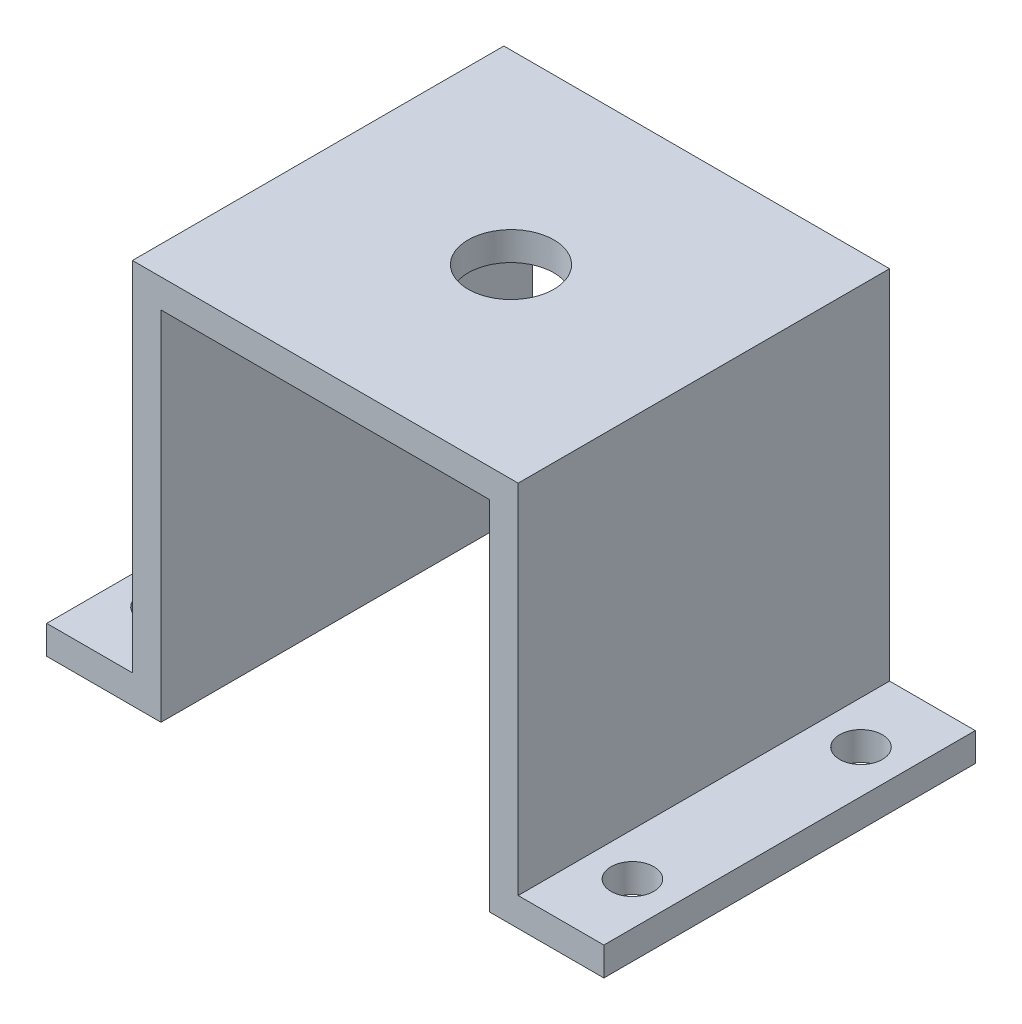
ISO-10303-21;
HEADER;
FILE_DESCRIPTION(('STEP AP214'),'2;1');
FILE_NAME('part.step','',(''),(''),'','','');
FILE_SCHEMA(('AUTOMOTIVE_DESIGN { 1 0 10303 214 1 1 1 1 }'));
ENDSEC;
DATA;
#1=APPLICATION_CONTEXT('core data for automotive mechanical design processes');
#2=APPLICATION_PROTOCOL_DEFINITION('international standard','automotive_design',2000,#1);
#3=PRODUCT_CONTEXT('',#1,'mechanical');
#4=PRODUCT('Part','Part','',(#3));
#5=PRODUCT_RELATED_PRODUCT_CATEGORY('part','',(#4));
#6=PRODUCT_DEFINITION_FORMATION('','',#4);
#7=PRODUCT_DEFINITION_CONTEXT('part definition',#1,'design');
#8=PRODUCT_DEFINITION('design','',#6,#7);
#9=PRODUCT_DEFINITION_SHAPE('','',#8);
#10=(LENGTH_UNIT() NAMED_UNIT(*) SI_UNIT(.MILLI.,.METRE.));
#11=(NAMED_UNIT(*) PLANE_ANGLE_UNIT() SI_UNIT($,.RADIAN.));
#12=(NAMED_UNIT(*) SI_UNIT($,.STERADIAN.) SOLID_ANGLE_UNIT());
#13=UNCERTAINTY_MEASURE_WITH_UNIT(LENGTH_MEASURE(1.E-05),#10,'distance_accuracy_value','');
#14=(GEOMETRIC_REPRESENTATION_CONTEXT(3) GLOBAL_UNCERTAINTY_ASSIGNED_CONTEXT((#13)) GLOBAL_UNIT_ASSIGNED_CONTEXT((#10,
#11,#12)) REPRESENTATION_CONTEXT('',''));
#15=CARTESIAN_POINT('',(0.,0.,0.));
#16=DIRECTION('',(0.,0.,1.));
#17=DIRECTION('',(1.,0.,0.));
#18=AXIS2_PLACEMENT_3D('',#15,#16,#17);
#19=CARTESIAN_POINT('',(31.,0.,26.));
#20=DIRECTION('',(0.,-1.,0.));
#21=DIRECTION('',(1.,0.,0.));
#22=AXIS2_PLACEMENT_3D('',#19,#20,#21);
#23=PLANE('',#22);
#24=CARTESIAN_POINT('',(28.,0.,21.));
#25=DIRECTION('',(0.,-1.,0.));
#26=DIRECTION('',(1.,0.,0.));
#27=AXIS2_PLACEMENT_3D('',#24,#25,#26);
#28=CIRCLE('',#27,1.5);
#29=CARTESIAN_POINT('',(29.5,0.,21.));
#30=VERTEX_POINT('',#29);
#31=EDGE_CURVE('E262',#30,#30,#28,.T.);
#32=ORIENTED_EDGE('',*,*,#31,.F.);
#33=EDGE_LOOP('',(#32));
#34=FACE_BOUND('',#33,.T.);
#35=DIRECTION('',(-1.,0.,0.));
#36=VECTOR('',#35,1.);
#37=CARTESIAN_POINT('',(31.,0.,0.));
#38=LINE('',#37,#36);
#39=CARTESIAN_POINT('',(31.,0.,0.));
#40=VERTEX_POINT('',#39);
#41=CARTESIAN_POINT('',(23.,0.,0.));
#42=VERTEX_POINT('',#41);
#43=EDGE_CURVE('E171',#40,#42,#38,.T.);
#44=ORIENTED_EDGE('',*,*,#43,.F.);
#45=DIRECTION('',(0.,0.,-1.));
#46=VECTOR('',#45,1.);
#47=CARTESIAN_POINT('',(31.,0.,26.));
#48=LINE('',#47,#46);
#49=CARTESIAN_POINT('',(31.,0.,26.));
#50=VERTEX_POINT('',#49);
#51=EDGE_CURVE('E187',#50,#40,#48,.T.);
#52=ORIENTED_EDGE('',*,*,#51,.F.);
#53=DIRECTION('',(-1.,0.,0.));
#54=VECTOR('',#53,1.);
#55=CARTESIAN_POINT('',(31.,0.,26.));
#56=LINE('',#55,#54);
#57=CARTESIAN_POINT('',(23.,0.,26.));
#58=VERTEX_POINT('',#57);
#59=EDGE_CURVE('E229',#50,#58,#56,.T.);
#60=ORIENTED_EDGE('',*,*,#59,.T.);
#61=DIRECTION('',(0.,0.,-1.));
#62=VECTOR('',#61,1.);
#63=CARTESIAN_POINT('',(23.,0.,26.));
#64=LINE('',#63,#62);
#65=EDGE_CURVE('E189',#58,#42,#64,.T.);
#66=ORIENTED_EDGE('',*,*,#65,.T.);
#67=EDGE_LOOP('',(#44,#52,#60,#66));
#68=FACE_BOUND('',#67,.T.);
#69=CARTESIAN_POINT('',(28.,0.,5.));
#70=DIRECTION('',(0.,-1.,0.));
#71=DIRECTION('',(1.,0.,0.));
#72=AXIS2_PLACEMENT_3D('',#69,#70,#71);
#73=CIRCLE('',#72,1.5);
#74=CARTESIAN_POINT('',(29.5,0.,5.));
#75=VERTEX_POINT('',#74);
#76=EDGE_CURVE('E254',#75,#75,#73,.T.);
#77=ORIENTED_EDGE('',*,*,#76,.F.);
#78=EDGE_LOOP('',(#77));
#79=FACE_BOUND('',#78,.T.);
#80=ADVANCED_FACE('F31',(#34,#68,#79),#23,.T.);
#81=CARTESIAN_POINT('',(31.,2.,26.));
#82=DIRECTION('',(0.,-1.,0.));
#83=DIRECTION('',(1.,0.,0.));
#84=AXIS2_PLACEMENT_3D('',#81,#82,#83);
#85=PLANE('',#84);
#86=CARTESIAN_POINT('',(28.,2.00000000000001,21.));
#87=DIRECTION('',(0.,-1.,0.));
#88=DIRECTION('',(0.,0.,1.));
#89=AXIS2_PLACEMENT_3D('',#86,#87,#88);
#90=CIRCLE('',#89,1.5);
#91=CARTESIAN_POINT('',(28.,2.00000000000001,22.5));
#92=VERTEX_POINT('',#91);
#93=EDGE_CURVE('E257',#92,#92,#90,.T.);
#94=ORIENTED_EDGE('',*,*,#93,.T.);
#95=EDGE_LOOP('',(#94));
#96=FACE_BOUND('',#95,.T.);
#97=DIRECTION('',(-1.,0.,0.));
#98=VECTOR('',#97,1.);
#99=CARTESIAN_POINT('',(31.,2.,0.));
#100=LINE('',#99,#98);
#101=CARTESIAN_POINT('',(31.,2.,0.));
#102=VERTEX_POINT('',#101);
#103=CARTESIAN_POINT('',(25.,2.,0.));
#104=VERTEX_POINT('',#103);
#105=EDGE_CURVE('E177',#102,#104,#100,.T.);
#106=ORIENTED_EDGE('',*,*,#105,.T.);
#107=DIRECTION('',(0.,0.,-1.));
#108=VECTOR('',#107,1.);
#109=CARTESIAN_POINT('',(25.,2.,26.));
#110=LINE('',#109,#108);
#111=CARTESIAN_POINT('',(25.,2.,26.));
#112=VERTEX_POINT('',#111);
#113=EDGE_CURVE('E143',#112,#104,#110,.T.);
#114=ORIENTED_EDGE('',*,*,#113,.F.);
#115=DIRECTION('',(-1.,0.,0.));
#116=VECTOR('',#115,1.);
#117=CARTESIAN_POINT('',(31.,2.,26.));
#118=LINE('',#117,#116);
#119=CARTESIAN_POINT('',(31.,2.,26.));
#120=VERTEX_POINT('',#119);
#121=EDGE_CURVE('E134',#120,#112,#118,.T.);
#122=ORIENTED_EDGE('',*,*,#121,.F.);
#123=DIRECTION('',(0.,0.,-1.));
#124=VECTOR('',#123,1.);
#125=CARTESIAN_POINT('',(31.,2.,26.));
#126=LINE('',#125,#124);
#127=EDGE_CURVE('E185',#120,#102,#126,.T.);
#128=ORIENTED_EDGE('',*,*,#127,.T.);
#129=EDGE_LOOP('',(#106,#114,#122,#128));
#130=FACE_BOUND('',#129,.T.);
#131=CARTESIAN_POINT('',(28.,2.00000000000001,5.));
#132=DIRECTION('',(0.,-1.,0.));
#133=DIRECTION('',(0.,0.,1.));
#134=AXIS2_PLACEMENT_3D('',#131,#132,#133);
#135=CIRCLE('',#134,1.5);
#136=CARTESIAN_POINT('',(28.,2.00000000000001,6.5));
#137=VERTEX_POINT('',#136);
#138=EDGE_CURVE('E252',#137,#137,#135,.T.);
#139=ORIENTED_EDGE('',*,*,#138,.T.);
#140=EDGE_LOOP('',(#139));
#141=FACE_BOUND('',#140,.T.);
#142=ADVANCED_FACE('F245',(#96,#130,#141),#85,.F.);
#143=CARTESIAN_POINT('',(-8.,2.,26.));
#144=DIRECTION('',(0.,-1.,0.));
#145=DIRECTION('',(0.,0.,-1.));
#146=AXIS2_PLACEMENT_3D('',#143,#144,#145);
#147=PLANE('',#146);
#148=CARTESIAN_POINT('',(-5.,2.,5.));
#149=DIRECTION('',(0.,1.,0.));
#150=DIRECTION('',(0.,0.,1.));
#151=AXIS2_PLACEMENT_3D('',#148,#149,#150);
#152=CIRCLE('',#151,1.5);
#153=CARTESIAN_POINT('',(-5.,2.,6.5));
#154=VERTEX_POINT('',#153);
#155=EDGE_CURVE('E266',#154,#154,#152,.T.);
#156=ORIENTED_EDGE('',*,*,#155,.F.);
#157=EDGE_LOOP('',(#156));
#158=FACE_BOUND('',#157,.T.);
#159=CARTESIAN_POINT('',(-5.,2.,21.));
#160=DIRECTION('',(0.,1.,0.));
#161=DIRECTION('',(0.,0.,1.));
#162=AXIS2_PLACEMENT_3D('',#159,#160,#161);
#163=CIRCLE('',#162,1.5);
#164=CARTESIAN_POINT('',(-5.,2.,22.5));
#165=VERTEX_POINT('',#164);
#166=EDGE_CURVE('E272',#165,#165,#163,.T.);
#167=ORIENTED_EDGE('',*,*,#166,.F.);
#168=EDGE_LOOP('',(#167));
#169=FACE_BOUND('',#168,.T.);
#170=DIRECTION('',(1.,0.,0.));
#171=VECTOR('',#170,1.);
#172=CARTESIAN_POINT('',(-8.,2.,0.));
#173=LINE('',#172,#171);
#174=CARTESIAN_POINT('',(-2.,2.,0.));
#175=VERTEX_POINT('',#174);
#176=CARTESIAN_POINT('',(-8.,2.,0.));
#177=VERTEX_POINT('',#176);
#178=EDGE_CURVE('E152',#175,#177,#173,.F.);
#179=ORIENTED_EDGE('',*,*,#178,.T.);
#180=DIRECTION('',(0.,0.,-1.));
#181=VECTOR('',#180,1.);
#182=CARTESIAN_POINT('',(-8.,2.,26.));
#183=LINE('',#182,#181);
#184=CARTESIAN_POINT('',(-8.,2.,26.));
#185=VERTEX_POINT('',#184);
#186=EDGE_CURVE('E11',#185,#177,#183,.T.);
#187=ORIENTED_EDGE('',*,*,#186,.F.);
#188=DIRECTION('',(1.,0.,0.));
#189=VECTOR('',#188,1.);
#190=CARTESIAN_POINT('',(-8.,2.,26.));
#191=LINE('',#190,#189);
#192=CARTESIAN_POINT('',(-2.,2.,26.));
#193=VERTEX_POINT('',#192);
#194=EDGE_CURVE('E100',#193,#185,#191,.F.);
#195=ORIENTED_EDGE('',*,*,#194,.F.);
#196=DIRECTION('',(0.,0.,-1.));
#197=VECTOR('',#196,1.);
#198=CARTESIAN_POINT('',(-2.,2.,26.));
#199=LINE('',#198,#197);
#200=EDGE_CURVE('E148',#193,#175,#199,.T.);
#201=ORIENTED_EDGE('',*,*,#200,.T.);
#202=EDGE_LOOP('',(#179,#187,#195,#201));
#203=FACE_BOUND('',#202,.T.);
#204=ADVANCED_FACE('F33',(#158,#169,#203),#147,.F.);
#205=CARTESIAN_POINT('',(-8.,0.,26.));
#206=DIRECTION('',(-1.,0.,0.));
#207=DIRECTION('',(0.,0.,1.));
#208=AXIS2_PLACEMENT_3D('',#205,#206,#207);
#209=PLANE('',#208);
#210=DIRECTION('',(0.,1.,0.));
#211=VECTOR('',#210,1.);
#212=CARTESIAN_POINT('',(-8.,0.,0.));
#213=LINE('',#212,#211);
#214=CARTESIAN_POINT('',(-8.,0.,0.));
#215=VERTEX_POINT('',#214);
#216=EDGE_CURVE('E155',#215,#177,#213,.T.);
#217=ORIENTED_EDGE('',*,*,#216,.F.);
#218=DIRECTION('',(0.,0.,-1.));
#219=VECTOR('',#218,1.);
#220=CARTESIAN_POINT('',(-8.,0.,26.));
#221=LINE('',#220,#219);
#222=CARTESIAN_POINT('',(-8.,0.,26.));
#223=VERTEX_POINT('',#222);
#224=EDGE_CURVE('E40',#223,#215,#221,.T.);
#225=ORIENTED_EDGE('',*,*,#224,.F.);
#226=DIRECTION('',(0.,1.,0.));
#227=VECTOR('',#226,1.);
#228=CARTESIAN_POINT('',(-8.,0.,26.));
#229=LINE('',#228,#227);
#230=EDGE_CURVE('E218',#223,#185,#229,.T.);
#231=ORIENTED_EDGE('',*,*,#230,.T.);
#232=ORIENTED_EDGE('',*,*,#186,.T.);
#233=EDGE_LOOP('',(#217,#225,#231,#232));
#234=FACE_BOUND('',#233,.T.);
#235=ADVANCED_FACE('F205',(#234),#209,.T.);
#236=CARTESIAN_POINT('',(-8.,0.,26.));
#237=DIRECTION('',(0.,-1.,0.));
#238=DIRECTION('',(0.,0.,-1.));
#239=AXIS2_PLACEMENT_3D('',#236,#237,#238);
#240=PLANE('',#239);
#241=CARTESIAN_POINT('',(-5.,0.,5.));
#242=DIRECTION('',(0.,-1.,0.));
#243=DIRECTION('',(0.,0.,-1.));
#244=AXIS2_PLACEMENT_3D('',#241,#242,#243);
#245=CIRCLE('',#244,1.5);
#246=CARTESIAN_POINT('',(-5.,0.,3.5));
#247=VERTEX_POINT('',#246);
#248=EDGE_CURVE('E265',#247,#247,#245,.F.);
#249=ORIENTED_EDGE('',*,*,#248,.T.);
#250=EDGE_LOOP('',(#249));
#251=FACE_BOUND('',#250,.T.);
#252=CARTESIAN_POINT('',(-5.,0.,21.));
#253=DIRECTION('',(0.,-1.,0.));
#254=DIRECTION('',(0.,0.,-1.));
#255=AXIS2_PLACEMENT_3D('',#252,#253,#254);
#256=CIRCLE('',#255,1.5);
#257=CARTESIAN_POINT('',(-5.,0.,19.5));
#258=VERTEX_POINT('',#257);
#259=EDGE_CURVE('E269',#258,#258,#256,.F.);
#260=ORIENTED_EDGE('',*,*,#259,.T.);
#261=EDGE_LOOP('',(#260));
#262=FACE_BOUND('',#261,.T.);
#263=DIRECTION('',(-1.,0.,0.));
#264=VECTOR('',#263,1.);
#265=CARTESIAN_POINT('',(-8.,0.,0.));
#266=LINE('',#265,#264);
#267=CARTESIAN_POINT('',(0.,0.,0.));
#268=VERTEX_POINT('',#267);
#269=EDGE_CURVE('E159',#268,#215,#266,.T.);
#270=ORIENTED_EDGE('',*,*,#269,.F.);
#271=DIRECTION('',(0.,0.,-1.));
#272=VECTOR('',#271,1.);
#273=CARTESIAN_POINT('',(0.,0.,26.));
#274=LINE('',#273,#272);
#275=CARTESIAN_POINT('',(0.,0.,26.));
#276=VERTEX_POINT('',#275);
#277=EDGE_CURVE('E195',#276,#268,#274,.T.);
#278=ORIENTED_EDGE('',*,*,#277,.F.);
#279=DIRECTION('',(-1.,0.,0.));
#280=VECTOR('',#279,1.);
#281=CARTESIAN_POINT('',(-8.,0.,26.));
#282=LINE('',#281,#280);
#283=EDGE_CURVE('E202',#276,#223,#282,.T.);
#284=ORIENTED_EDGE('',*,*,#283,.T.);
#285=ORIENTED_EDGE('',*,*,#224,.T.);
#286=EDGE_LOOP('',(#270,#278,#284,#285));
#287=FACE_BOUND('',#286,.T.);
#288=ADVANCED_FACE('F200',(#251,#262,#287),#240,.T.);
#289=CARTESIAN_POINT('',(0.,0.,26.));
#290=DIRECTION('',(1.,0.,0.));
#291=DIRECTION('',(0.,1.,0.));
#292=AXIS2_PLACEMENT_3D('',#289,#290,#291);
#293=PLANE('',#292);
#294=DIRECTION('',(0.,-1.,0.));
#295=VECTOR('',#294,1.);
#296=CARTESIAN_POINT('',(0.,0.,0.));
#297=LINE('',#296,#295);
#298=CARTESIAN_POINT('',(0.,25.,0.));
#299=VERTEX_POINT('',#298);
#300=EDGE_CURVE('E162',#299,#268,#297,.T.);
#301=ORIENTED_EDGE('',*,*,#300,.F.);
#302=DIRECTION('',(0.,0.,-1.));
#303=VECTOR('',#302,1.);
#304=CARTESIAN_POINT('',(0.,25.,26.));
#305=LINE('',#304,#303);
#306=CARTESIAN_POINT('',(0.,25.,26.));
#307=VERTEX_POINT('',#306);
#308=EDGE_CURVE('E193',#307,#299,#305,.T.);
#309=ORIENTED_EDGE('',*,*,#308,.F.);
#310=DIRECTION('',(0.,-1.,0.));
#311=VECTOR('',#310,1.);
#312=CARTESIAN_POINT('',(0.,0.,26.));
#313=LINE('',#312,#311);
#314=EDGE_CURVE('E215',#307,#276,#313,.T.);
#315=ORIENTED_EDGE('',*,*,#314,.T.);
#316=ORIENTED_EDGE('',*,*,#277,.T.);
#317=EDGE_LOOP('',(#301,#309,#315,#316));
#318=FACE_BOUND('',#317,.T.);
#319=ADVANCED_FACE('F212',(#318),#293,.T.);
#320=CARTESIAN_POINT('',(0.,25.,26.));
#321=DIRECTION('',(0.,-1.,0.));
#322=DIRECTION('',(1.,0.,0.));
#323=AXIS2_PLACEMENT_3D('',#320,#321,#322);
#324=PLANE('',#323);
#325=CARTESIAN_POINT('',(11.5,25.,13.));
#326=DIRECTION('',(0.,-1.,0.));
#327=DIRECTION('',(1.,0.,0.));
#328=AXIS2_PLACEMENT_3D('',#325,#326,#327);
#329=CIRCLE('',#328,3.);
#330=CARTESIAN_POINT('',(14.5,25.,13.));
#331=VERTEX_POINT('',#330);
#332=EDGE_CURVE('E275',#331,#331,#329,.F.);
#333=ORIENTED_EDGE('',*,*,#332,.T.);
#334=EDGE_LOOP('',(#333));
#335=FACE_BOUND('',#334,.T.);
#336=DIRECTION('',(-1.,0.,0.));
#337=VECTOR('',#336,1.);
#338=CARTESIAN_POINT('',(0.,25.,0.));
#339=LINE('',#338,#337);
#340=CARTESIAN_POINT('',(23.,25.,0.));
#341=VERTEX_POINT('',#340);
#342=EDGE_CURVE('E165',#341,#299,#339,.T.);
#343=ORIENTED_EDGE('',*,*,#342,.F.);
#344=DIRECTION('',(0.,0.,-1.));
#345=VECTOR('',#344,1.);
#346=CARTESIAN_POINT('',(23.,25.,26.));
#347=LINE('',#346,#345);
#348=CARTESIAN_POINT('',(23.,25.,26.));
#349=VERTEX_POINT('',#348);
#350=EDGE_CURVE('E191',#349,#341,#347,.T.);
#351=ORIENTED_EDGE('',*,*,#350,.F.);
#352=DIRECTION('',(-1.,0.,0.));
#353=VECTOR('',#352,1.);
#354=CARTESIAN_POINT('',(0.,25.,26.));
#355=LINE('',#354,#353);
#356=EDGE_CURVE('E220',#349,#307,#355,.T.);
#357=ORIENTED_EDGE('',*,*,#356,.T.);
#358=ORIENTED_EDGE('',*,*,#308,.T.);
#359=EDGE_LOOP('',(#343,#351,#357,#358));
#360=FACE_BOUND('',#359,.T.);
#361=ADVANCED_FACE('F283',(#335,#360),#324,.T.);
#362=CARTESIAN_POINT('',(23.,25.,26.));
#363=DIRECTION('',(-1.,0.,0.));
#364=DIRECTION('',(0.,0.,1.));
#365=AXIS2_PLACEMENT_3D('',#362,#363,#364);
#366=PLANE('',#365);
#367=DIRECTION('',(0.,1.,0.));
#368=VECTOR('',#367,1.);
#369=CARTESIAN_POINT('',(23.,25.,0.));
#370=LINE('',#369,#368);
#371=EDGE_CURVE('E168',#42,#341,#370,.T.);
#372=ORIENTED_EDGE('',*,*,#371,.F.);
#373=ORIENTED_EDGE('',*,*,#65,.F.);
#374=DIRECTION('',(0.,1.,0.));
#375=VECTOR('',#374,1.);
#376=CARTESIAN_POINT('',(23.,25.,26.));
#377=LINE('',#376,#375);
#378=EDGE_CURVE('E226',#58,#349,#377,.T.);
#379=ORIENTED_EDGE('',*,*,#378,.T.);
#380=ORIENTED_EDGE('',*,*,#350,.T.);
#381=EDGE_LOOP('',(#372,#373,#379,#380));
#382=FACE_BOUND('',#381,.T.);
#383=ADVANCED_FACE('F310',(#382),#366,.T.);
#384=CARTESIAN_POINT('',(31.,2.,26.));
#385=DIRECTION('',(1.,0.,0.));
#386=DIRECTION('',(0.,0.,-1.));
#387=AXIS2_PLACEMENT_3D('',#384,#385,#386);
#388=PLANE('',#387);
#389=DIRECTION('',(0.,-1.,0.));
#390=VECTOR('',#389,1.);
#391=CARTESIAN_POINT('',(31.,2.,0.));
#392=LINE('',#391,#390);
#393=EDGE_CURVE('E174',#102,#40,#392,.T.);
#394=ORIENTED_EDGE('',*,*,#393,.F.);
#395=ORIENTED_EDGE('',*,*,#127,.F.);
#396=DIRECTION('',(0.,-1.,0.));
#397=VECTOR('',#396,1.);
#398=CARTESIAN_POINT('',(31.,2.,26.));
#399=LINE('',#398,#397);
#400=EDGE_CURVE('E232',#120,#50,#399,.T.);
#401=ORIENTED_EDGE('',*,*,#400,.T.);
#402=ORIENTED_EDGE('',*,*,#51,.T.);
#403=EDGE_LOOP('',(#394,#395,#401,#402));
#404=FACE_BOUND('',#403,.T.);
#405=ADVANCED_FACE('F236',(#404),#388,.T.);
#406=CARTESIAN_POINT('',(25.,25.,26.));
#407=DIRECTION('',(-1.,0.,0.));
#408=DIRECTION('',(0.,0.,1.));
#409=AXIS2_PLACEMENT_3D('',#406,#407,#408);
#410=PLANE('',#409);
#411=DIRECTION('',(0.,1.,0.));
#412=VECTOR('',#411,1.);
#413=CARTESIAN_POINT('',(25.,25.,0.));
#414=LINE('',#413,#412);
#415=CARTESIAN_POINT('',(25.,27.,0.));
#416=VERTEX_POINT('',#415);
#417=EDGE_CURVE('E142',#104,#416,#414,.T.);
#418=ORIENTED_EDGE('',*,*,#417,.T.);
#419=DIRECTION('',(0.,0.,-1.));
#420=VECTOR('',#419,1.);
#421=CARTESIAN_POINT('',(25.,27.,26.));
#422=LINE('',#421,#420);
#423=CARTESIAN_POINT('',(25.,27.,26.));
#424=VERTEX_POINT('',#423);
#425=EDGE_CURVE('E139',#424,#416,#422,.T.);
#426=ORIENTED_EDGE('',*,*,#425,.F.);
#427=DIRECTION('',(0.,1.,0.));
#428=VECTOR('',#427,1.);
#429=CARTESIAN_POINT('',(25.,25.,26.));
#430=LINE('',#429,#428);
#431=EDGE_CURVE('E127',#112,#424,#430,.T.);
#432=ORIENTED_EDGE('',*,*,#431,.F.);
#433=ORIENTED_EDGE('',*,*,#113,.T.);
#434=EDGE_LOOP('',(#418,#426,#432,#433));
#435=FACE_BOUND('',#434,.T.);
#436=ADVANCED_FACE('F140',(#435),#410,.F.);
#437=CARTESIAN_POINT('',(0.,27.,26.));
#438=DIRECTION('',(0.,-1.,0.));
#439=DIRECTION('',(1.,0.,0.));
#440=AXIS2_PLACEMENT_3D('',#437,#438,#439);
#441=PLANE('',#440);
#442=CARTESIAN_POINT('',(11.5,27.,13.));
#443=DIRECTION('',(0.,1.,0.));
#444=DIRECTION('',(-1.,0.,0.));
#445=AXIS2_PLACEMENT_3D('',#442,#443,#444);
#446=CIRCLE('',#445,3.);
#447=CARTESIAN_POINT('',(8.49999999999999,27.,13.));
#448=VERTEX_POINT('',#447);
#449=EDGE_CURVE('E156',#448,#448,#446,.T.);
#450=ORIENTED_EDGE('',*,*,#449,.F.);
#451=EDGE_LOOP('',(#450));
#452=FACE_BOUND('',#451,.T.);
#453=DIRECTION('',(-1.,0.,0.));
#454=VECTOR('',#453,1.);
#455=CARTESIAN_POINT('',(0.,27.,0.));
#456=LINE('',#455,#454);
#457=CARTESIAN_POINT('',(-2.,27.,0.));
#458=VERTEX_POINT('',#457);
#459=EDGE_CURVE('E88',#416,#458,#456,.T.);
#460=ORIENTED_EDGE('',*,*,#459,.T.);
#461=DIRECTION('',(0.,0.,-1.));
#462=VECTOR('',#461,1.);
#463=CARTESIAN_POINT('',(-2.,27.,26.));
#464=LINE('',#463,#462);
#465=CARTESIAN_POINT('',(-2.,27.,26.));
#466=VERTEX_POINT('',#465);
#467=EDGE_CURVE('E144',#466,#458,#464,.T.);
#468=ORIENTED_EDGE('',*,*,#467,.F.);
#469=DIRECTION('',(-1.,0.,0.));
#470=VECTOR('',#469,1.);
#471=CARTESIAN_POINT('',(0.,27.,26.));
#472=LINE('',#471,#470);
#473=EDGE_CURVE('E131',#424,#466,#472,.T.);
#474=ORIENTED_EDGE('',*,*,#473,.F.);
#475=ORIENTED_EDGE('',*,*,#425,.T.);
#476=EDGE_LOOP('',(#460,#468,#474,#475));
#477=FACE_BOUND('',#476,.T.);
#478=ADVANCED_FACE('F146',(#452,#477),#441,.F.);
#479=CARTESIAN_POINT('',(-2.,0.,26.));
#480=DIRECTION('',(1.,0.,0.));
#481=DIRECTION('',(0.,1.,0.));
#482=AXIS2_PLACEMENT_3D('',#479,#480,#481);
#483=PLANE('',#482);
#484=DIRECTION('',(0.,-1.,0.));
#485=VECTOR('',#484,1.);
#486=CARTESIAN_POINT('',(-2.,0.,0.));
#487=LINE('',#486,#485);
#488=EDGE_CURVE('E94',#458,#175,#487,.T.);
#489=ORIENTED_EDGE('',*,*,#488,.T.);
#490=ORIENTED_EDGE('',*,*,#200,.F.);
#491=DIRECTION('',(0.,-1.,0.));
#492=VECTOR('',#491,1.);
#493=CARTESIAN_POINT('',(-2.,0.,26.));
#494=LINE('',#493,#492);
#495=EDGE_CURVE('E48',#466,#193,#494,.T.);
#496=ORIENTED_EDGE('',*,*,#495,.F.);
#497=ORIENTED_EDGE('',*,*,#467,.T.);
#498=EDGE_LOOP('',(#489,#490,#496,#497));
#499=FACE_BOUND('',#498,.T.);
#500=ADVANCED_FACE('F294',(#499),#483,.F.);
#501=CARTESIAN_POINT('',(-8.,2.,26.));
#502=DIRECTION('',(0.,0.,1.));
#503=DIRECTION('',(1.,0.,0.));
#504=AXIS2_PLACEMENT_3D('',#501,#502,#503);
#505=PLANE('',#504);
#506=ORIENTED_EDGE('',*,*,#194,.T.);
#507=ORIENTED_EDGE('',*,*,#230,.F.);
#508=ORIENTED_EDGE('',*,*,#283,.F.);
#509=ORIENTED_EDGE('',*,*,#314,.F.);
#510=ORIENTED_EDGE('',*,*,#356,.F.);
#511=ORIENTED_EDGE('',*,*,#378,.F.);
#512=ORIENTED_EDGE('',*,*,#59,.F.);
#513=ORIENTED_EDGE('',*,*,#400,.F.);
#514=ORIENTED_EDGE('',*,*,#121,.T.);
#515=ORIENTED_EDGE('',*,*,#431,.T.);
#516=ORIENTED_EDGE('',*,*,#473,.T.);
#517=ORIENTED_EDGE('',*,*,#495,.T.);
#518=EDGE_LOOP('',(#506,#507,#508,#509,#510,#511,#512,#513,#514,#515,#516,#517));
#519=FACE_BOUND('',#518,.T.);
#520=ADVANCED_FACE('F129',(#519),#505,.T.);
#521=CARTESIAN_POINT('',(-8.,2.,0.));
#522=DIRECTION('',(0.,0.,1.));
#523=DIRECTION('',(1.,0.,0.));
#524=AXIS2_PLACEMENT_3D('',#521,#522,#523);
#525=PLANE('',#524);
#526=ORIENTED_EDGE('',*,*,#178,.F.);
#527=ORIENTED_EDGE('',*,*,#488,.F.);
#528=ORIENTED_EDGE('',*,*,#459,.F.);
#529=ORIENTED_EDGE('',*,*,#417,.F.);
#530=ORIENTED_EDGE('',*,*,#105,.F.);
#531=ORIENTED_EDGE('',*,*,#393,.T.);
#532=ORIENTED_EDGE('',*,*,#43,.T.);
#533=ORIENTED_EDGE('',*,*,#371,.T.);
#534=ORIENTED_EDGE('',*,*,#342,.T.);
#535=ORIENTED_EDGE('',*,*,#300,.T.);
#536=ORIENTED_EDGE('',*,*,#269,.T.);
#537=ORIENTED_EDGE('',*,*,#216,.T.);
#538=EDGE_LOOP('',(#526,#527,#528,#529,#530,#531,#532,#533,#534,#535,#536,#537));
#539=FACE_BOUND('',#538,.T.);
#540=ADVANCED_FACE('F208',(#539),#525,.F.);
#541=CARTESIAN_POINT('',(11.5,-0.00100000000000794,13.));
#542=DIRECTION('',(0.,1.,0.));
#543=DIRECTION('',(-1.,0.,0.));
#544=AXIS2_PLACEMENT_3D('',#541,#542,#543);
#545=CYLINDRICAL_SURFACE('',#544,3.);
#546=ORIENTED_EDGE('',*,*,#332,.F.);
#547=EDGE_LOOP('',(#546));
#548=FACE_BOUND('',#547,.T.);
#549=ORIENTED_EDGE('',*,*,#449,.T.);
#550=EDGE_LOOP('',(#549));
#551=FACE_BOUND('',#550,.T.);
#552=ADVANCED_FACE('F286',(#548,#551),#545,.F.);
#553=CARTESIAN_POINT('',(-5.,-0.00100000000000013,21.));
#554=DIRECTION('',(0.,1.,0.));
#555=DIRECTION('',(0.,0.,1.));
#556=AXIS2_PLACEMENT_3D('',#553,#554,#555);
#557=CYLINDRICAL_SURFACE('',#556,1.5);
#558=ORIENTED_EDGE('',*,*,#259,.F.);
#559=EDGE_LOOP('',(#558));
#560=FACE_BOUND('',#559,.T.);
#561=ORIENTED_EDGE('',*,*,#166,.T.);
#562=EDGE_LOOP('',(#561));
#563=FACE_BOUND('',#562,.T.);
#564=ADVANCED_FACE('F289',(#560,#563),#557,.F.);
#565=CARTESIAN_POINT('',(-5.,-0.00100000000000013,5.));
#566=DIRECTION('',(0.,1.,0.));
#567=DIRECTION('',(0.,0.,1.));
#568=AXIS2_PLACEMENT_3D('',#565,#566,#567);
#569=CYLINDRICAL_SURFACE('',#568,1.5);
#570=ORIENTED_EDGE('',*,*,#248,.F.);
#571=EDGE_LOOP('',(#570));
#572=FACE_BOUND('',#571,.T.);
#573=ORIENTED_EDGE('',*,*,#155,.T.);
#574=EDGE_LOOP('',(#573));
#575=FACE_BOUND('',#574,.T.);
#576=ADVANCED_FACE('F333',(#572,#575),#569,.F.);
#577=CARTESIAN_POINT('',(28.,-0.0010000000000023,21.));
#578=DIRECTION('',(0.,1.,0.));
#579=DIRECTION('',(-1.,0.,0.));
#580=AXIS2_PLACEMENT_3D('',#577,#578,#579);
#581=CYLINDRICAL_SURFACE('',#580,1.5);
#582=ORIENTED_EDGE('',*,*,#31,.T.);
#583=EDGE_LOOP('',(#582));
#584=FACE_BOUND('',#583,.T.);
#585=ORIENTED_EDGE('',*,*,#93,.F.);
#586=EDGE_LOOP('',(#585));
#587=FACE_BOUND('',#586,.T.);
#588=ADVANCED_FACE('F339',(#584,#587),#581,.F.);
#589=CARTESIAN_POINT('',(28.,-0.0010000000000023,5.));
#590=DIRECTION('',(0.,1.,0.));
#591=DIRECTION('',(-1.,0.,0.));
#592=AXIS2_PLACEMENT_3D('',#589,#590,#591);
#593=CYLINDRICAL_SURFACE('',#592,1.5);
#594=ORIENTED_EDGE('',*,*,#76,.T.);
#595=EDGE_LOOP('',(#594));
#596=FACE_BOUND('',#595,.T.);
#597=ORIENTED_EDGE('',*,*,#138,.F.);
#598=EDGE_LOOP('',(#597));
#599=FACE_BOUND('',#598,.T.);
#600=ADVANCED_FACE('F400',(#596,#599),#593,.F.);
#601=CLOSED_SHELL('',(#80,#142,#204,#235,#288,#319,#361,#383,#405,#436,#478,#500,#520,#540,#552,
#564,#576,#588,#600));
#602=MANIFOLD_SOLID_BREP('B2',#601);
#603=ADVANCED_BREP_SHAPE_REPRESENTATION('',(#18,#602),#14);
#604=SHAPE_DEFINITION_REPRESENTATION(#9,#603);
ENDSEC;
END-ISO-10303-21;
